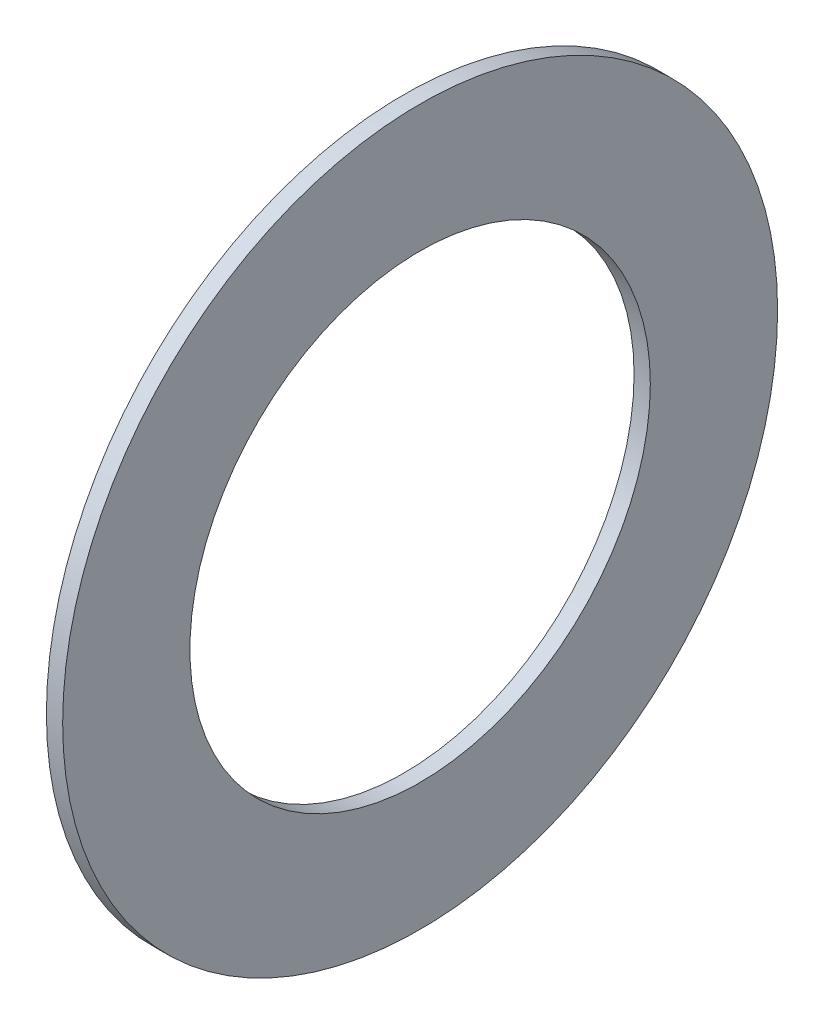
ISO-10303-21;
HEADER;
FILE_DESCRIPTION(('STEP AP214'),'2;1');
FILE_NAME('part.step','',(''),(''),'','','');
FILE_SCHEMA(('AUTOMOTIVE_DESIGN { 1 0 10303 214 1 1 1 1 }'));
ENDSEC;
DATA;
#1=APPLICATION_CONTEXT('core data for automotive mechanical design processes');
#2=APPLICATION_PROTOCOL_DEFINITION('international standard','automotive_design',2000,#1);
#3=PRODUCT_CONTEXT('',#1,'mechanical');
#4=PRODUCT('Part','Part','',(#3));
#5=PRODUCT_RELATED_PRODUCT_CATEGORY('part','',(#4));
#6=PRODUCT_DEFINITION_FORMATION('','',#4);
#7=PRODUCT_DEFINITION_CONTEXT('part definition',#1,'design');
#8=PRODUCT_DEFINITION('design','',#6,#7);
#9=PRODUCT_DEFINITION_SHAPE('','',#8);
#10=(LENGTH_UNIT() NAMED_UNIT(*) SI_UNIT(.MILLI.,.METRE.));
#11=(NAMED_UNIT(*) PLANE_ANGLE_UNIT() SI_UNIT($,.RADIAN.));
#12=(NAMED_UNIT(*) SI_UNIT($,.STERADIAN.) SOLID_ANGLE_UNIT());
#13=UNCERTAINTY_MEASURE_WITH_UNIT(LENGTH_MEASURE(1.E-05),#10,'distance_accuracy_value','');
#14=(GEOMETRIC_REPRESENTATION_CONTEXT(3) GLOBAL_UNCERTAINTY_ASSIGNED_CONTEXT((#13)) GLOBAL_UNIT_ASSIGNED_CONTEXT((#10,
#11,#12)) REPRESENTATION_CONTEXT('',''));
#15=CARTESIAN_POINT('',(0.,0.,0.));
#16=DIRECTION('',(0.,0.,1.));
#17=DIRECTION('',(1.,0.,0.));
#18=AXIS2_PLACEMENT_3D('',#15,#16,#17);
#19=CARTESIAN_POINT('',(4.9,0.,5.425));
#20=DIRECTION('',(1.,0.,0.));
#21=DIRECTION('',(0.,0.,-1.));
#22=AXIS2_PLACEMENT_3D('',#19,#20,#21);
#23=PLANE('',#22);
#24=CARTESIAN_POINT('',(4.9,0.,0.));
#25=DIRECTION('',(1.,0.,0.));
#26=DIRECTION('',(0.,0.,-1.));
#27=AXIS2_PLACEMENT_3D('',#24,#25,#26);
#28=CIRCLE('',#27,6.6);
#29=CARTESIAN_POINT('',(4.9,0.,-6.6));
#30=VERTEX_POINT('',#29);
#31=EDGE_CURVE('E17',#30,#30,#28,.F.);
#32=ORIENTED_EDGE('',*,*,#31,.F.);
#33=EDGE_LOOP('',(#32));
#34=FACE_BOUND('',#33,.T.);
#35=CARTESIAN_POINT('',(4.9,0.,0.));
#36=DIRECTION('',(1.,0.,0.));
#37=DIRECTION('',(0.,0.,-1.));
#38=AXIS2_PLACEMENT_3D('',#35,#36,#37);
#39=CIRCLE('',#38,4.25);
#40=CARTESIAN_POINT('',(4.9,0.,-4.25));
#41=VERTEX_POINT('',#40);
#42=EDGE_CURVE('E26',#41,#41,#39,.T.);
#43=ORIENTED_EDGE('',*,*,#42,.F.);
#44=EDGE_LOOP('',(#43));
#45=FACE_BOUND('',#44,.T.);
#46=ADVANCED_FACE('F14',(#34,#45),#23,.T.);
#47=CARTESIAN_POINT('',(4.75,0.,0.));
#48=DIRECTION('',(1.,0.,0.));
#49=DIRECTION('',(0.,0.,-1.));
#50=AXIS2_PLACEMENT_3D('',#47,#48,#49);
#51=CYLINDRICAL_SURFACE('',#50,6.6);
#52=ORIENTED_EDGE('',*,*,#31,.T.);
#53=EDGE_LOOP('',(#52));
#54=FACE_BOUND('',#53,.T.);
#55=CARTESIAN_POINT('',(4.6,0.,0.));
#56=DIRECTION('',(1.,0.,0.));
#57=DIRECTION('',(0.,0.,-1.));
#58=AXIS2_PLACEMENT_3D('',#55,#56,#57);
#59=CIRCLE('',#58,6.6);
#60=CARTESIAN_POINT('',(4.6,0.,-6.6));
#61=VERTEX_POINT('',#60);
#62=EDGE_CURVE('E21',#61,#61,#59,.F.);
#63=ORIENTED_EDGE('',*,*,#62,.F.);
#64=EDGE_LOOP('',(#63));
#65=FACE_BOUND('',#64,.T.);
#66=ADVANCED_FACE('F34',(#54,#65),#51,.T.);
#67=CARTESIAN_POINT('',(4.6,0.,0.));
#68=DIRECTION('',(1.,0.,0.));
#69=DIRECTION('',(0.,0.,-1.));
#70=AXIS2_PLACEMENT_3D('',#67,#68,#69);
#71=CYLINDRICAL_SURFACE('',#70,4.25);
#72=CARTESIAN_POINT('',(4.6,0.,0.));
#73=DIRECTION('',(1.,0.,0.));
#74=DIRECTION('',(0.,0.,-1.));
#75=AXIS2_PLACEMENT_3D('',#72,#73,#74);
#76=CIRCLE('',#75,4.25);
#77=CARTESIAN_POINT('',(4.6,0.,-4.25));
#78=VERTEX_POINT('',#77);
#79=EDGE_CURVE('E10',#78,#78,#76,.T.);
#80=ORIENTED_EDGE('',*,*,#79,.F.);
#81=EDGE_LOOP('',(#80));
#82=FACE_BOUND('',#81,.T.);
#83=ORIENTED_EDGE('',*,*,#42,.T.);
#84=EDGE_LOOP('',(#83));
#85=FACE_BOUND('',#84,.T.);
#86=ADVANCED_FACE('F43',(#82,#85),#71,.F.);
#87=CARTESIAN_POINT('',(4.6,0.,5.425));
#88=DIRECTION('',(-1.,0.,0.));
#89=DIRECTION('',(0.,0.,1.));
#90=AXIS2_PLACEMENT_3D('',#87,#88,#89);
#91=PLANE('',#90);
#92=ORIENTED_EDGE('',*,*,#79,.T.);
#93=EDGE_LOOP('',(#92));
#94=FACE_BOUND('',#93,.T.);
#95=ORIENTED_EDGE('',*,*,#62,.T.);
#96=EDGE_LOOP('',(#95));
#97=FACE_BOUND('',#96,.T.);
#98=ADVANCED_FACE('F44',(#94,#97),#91,.T.);
#99=CLOSED_SHELL('',(#46,#66,#86,#98));
#100=MANIFOLD_SOLID_BREP('B1',#99);
#101=ADVANCED_BREP_SHAPE_REPRESENTATION('',(#18,#100),#14);
#102=SHAPE_DEFINITION_REPRESENTATION(#9,#101);
ENDSEC;
END-ISO-10303-21;
